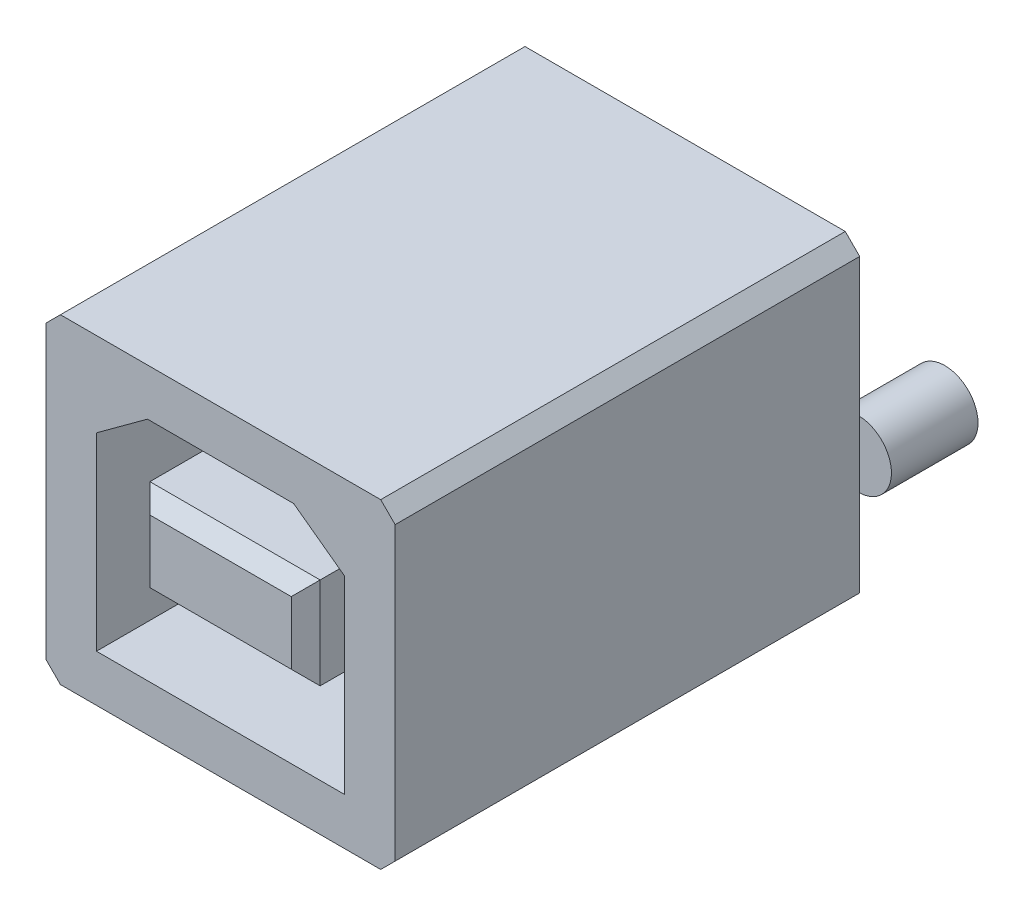
ISO-10303-21;
HEADER;
FILE_DESCRIPTION(('STEP AP214'),'2;1');
FILE_NAME('part.step','',(''),(''),'','','');
FILE_SCHEMA(('AUTOMOTIVE_DESIGN { 1 0 10303 214 1 1 1 1 }'));
ENDSEC;
DATA;
#1=APPLICATION_CONTEXT('core data for automotive mechanical design processes');
#2=APPLICATION_PROTOCOL_DEFINITION('international standard','automotive_design',2000,#1);
#3=PRODUCT_CONTEXT('',#1,'mechanical');
#4=PRODUCT('Part','Part','',(#3));
#5=PRODUCT_RELATED_PRODUCT_CATEGORY('part','',(#4));
#6=PRODUCT_DEFINITION_FORMATION('','',#4);
#7=PRODUCT_DEFINITION_CONTEXT('part definition',#1,'design');
#8=PRODUCT_DEFINITION('design','',#6,#7);
#9=PRODUCT_DEFINITION_SHAPE('','',#8);
#10=(LENGTH_UNIT() NAMED_UNIT(*) SI_UNIT(.MILLI.,.METRE.));
#11=(NAMED_UNIT(*) PLANE_ANGLE_UNIT() SI_UNIT($,.RADIAN.));
#12=(NAMED_UNIT(*) SI_UNIT($,.STERADIAN.) SOLID_ANGLE_UNIT());
#13=UNCERTAINTY_MEASURE_WITH_UNIT(LENGTH_MEASURE(1.E-05),#10,'distance_accuracy_value','');
#14=(GEOMETRIC_REPRESENTATION_CONTEXT(3) GLOBAL_UNCERTAINTY_ASSIGNED_CONTEXT((#13)) GLOBAL_UNIT_ASSIGNED_CONTEXT((#10,
#11,#12)) REPRESENTATION_CONTEXT('',''));
#15=CARTESIAN_POINT('',(0.,0.,0.));
#16=DIRECTION('',(0.,0.,1.));
#17=DIRECTION('',(1.,0.,0.));
#18=AXIS2_PLACEMENT_3D('',#15,#16,#17);
#19=CARTESIAN_POINT('',(0.,0.,16.1));
#20=DIRECTION('',(0.,0.,-1.));
#21=DIRECTION('',(-1.,0.,0.));
#22=AXIS2_PLACEMENT_3D('',#19,#20,#21);
#23=PLANE('',#22);
#24=DIRECTION('',(1.,0.,0.));
#25=VECTOR('',#24,1.);
#26=CARTESIAN_POINT('',(0.,-1.09,16.1));
#27=LINE('',#26,#25);
#28=CARTESIAN_POINT('',(2.45,-1.09,16.1));
#29=VERTEX_POINT('',#28);
#30=CARTESIAN_POINT('',(-2.45,-1.09,16.1));
#31=VERTEX_POINT('',#30);
#32=EDGE_CURVE('E359',#29,#31,#27,.F.);
#33=ORIENTED_EDGE('',*,*,#32,.F.);
#34=DIRECTION('',(0.,1.,0.));
#35=VECTOR('',#34,1.);
#36=CARTESIAN_POINT('',(2.45,0.,16.1));
#37=LINE('',#36,#35);
#38=CARTESIAN_POINT('',(2.45,1.09,16.1));
#39=VERTEX_POINT('',#38);
#40=EDGE_CURVE('E354',#39,#29,#37,.F.);
#41=ORIENTED_EDGE('',*,*,#40,.F.);
#42=DIRECTION('',(1.,0.,0.));
#43=VECTOR('',#42,1.);
#44=CARTESIAN_POINT('',(0.,1.09,16.1));
#45=LINE('',#44,#43);
#46=CARTESIAN_POINT('',(-2.45,1.09,16.1));
#47=VERTEX_POINT('',#46);
#48=EDGE_CURVE('E369',#47,#39,#45,.T.);
#49=ORIENTED_EDGE('',*,*,#48,.F.);
#50=DIRECTION('',(0.,1.,0.));
#51=VECTOR('',#50,1.);
#52=CARTESIAN_POINT('',(-2.45,0.,16.1));
#53=LINE('',#52,#51);
#54=EDGE_CURVE('E364',#31,#47,#53,.T.);
#55=ORIENTED_EDGE('',*,*,#54,.F.);
#56=EDGE_LOOP('',(#33,#41,#49,#55));
#57=FACE_BOUND('',#56,.T.);
#58=ADVANCED_FACE('F16',(#57),#23,.F.);
#59=CARTESIAN_POINT('',(0.,1.09,16.1));
#60=DIRECTION('',(0.,0.707106781186548,0.707106781186548));
#61=DIRECTION('',(0.,-0.707106781186548,0.707106781186548));
#62=AXIS2_PLACEMENT_3D('',#59,#60,#61);
#63=PLANE('',#62);
#64=DIRECTION('',(-0.577350269189626,0.577350269189624,-0.577350269189626));
#65=VECTOR('',#64,1.);
#66=CARTESIAN_POINT('',(-2.45,1.09,16.1));
#67=LINE('',#66,#65);
#68=CARTESIAN_POINT('',(-2.95,1.59,15.6));
#69=VERTEX_POINT('',#68);
#70=EDGE_CURVE('E367',#47,#69,#67,.T.);
#71=ORIENTED_EDGE('',*,*,#70,.F.);
#72=ORIENTED_EDGE('',*,*,#48,.T.);
#73=DIRECTION('',(-0.577350269189626,-0.577350269189624,0.577350269189626));
#74=VECTOR('',#73,1.);
#75=CARTESIAN_POINT('',(2.95,1.59,15.6));
#76=LINE('',#75,#74);
#77=CARTESIAN_POINT('',(2.95,1.59,15.6));
#78=VERTEX_POINT('',#77);
#79=EDGE_CURVE('E356',#78,#39,#76,.T.);
#80=ORIENTED_EDGE('',*,*,#79,.F.);
#81=DIRECTION('',(1.,0.,0.));
#82=VECTOR('',#81,1.);
#83=CARTESIAN_POINT('',(-2.95,1.59,15.6));
#84=LINE('',#83,#82);
#85=EDGE_CURVE('E350',#69,#78,#84,.T.);
#86=ORIENTED_EDGE('',*,*,#85,.F.);
#87=EDGE_LOOP('',(#71,#72,#80,#86));
#88=FACE_BOUND('',#87,.T.);
#89=ADVANCED_FACE('F772',(#88),#63,.T.);
#90=CARTESIAN_POINT('',(-2.45,0.,16.1));
#91=DIRECTION('',(-0.707106781186548,0.,0.707106781186548));
#92=DIRECTION('',(0.707106781186548,0.,0.707106781186548));
#93=AXIS2_PLACEMENT_3D('',#90,#91,#92);
#94=PLANE('',#93);
#95=DIRECTION('',(-0.577350269189625,-0.577350269189626,-0.577350269189626));
#96=VECTOR('',#95,1.);
#97=CARTESIAN_POINT('',(-2.45,-1.09,16.1));
#98=LINE('',#97,#96);
#99=CARTESIAN_POINT('',(-2.95,-1.59,15.6));
#100=VERTEX_POINT('',#99);
#101=EDGE_CURVE('E362',#31,#100,#98,.T.);
#102=ORIENTED_EDGE('',*,*,#101,.F.);
#103=ORIENTED_EDGE('',*,*,#54,.T.);
#104=ORIENTED_EDGE('',*,*,#70,.T.);
#105=DIRECTION('',(0.,1.,0.));
#106=VECTOR('',#105,1.);
#107=CARTESIAN_POINT('',(-2.95,1.59,15.6));
#108=LINE('',#107,#106);
#109=EDGE_CURVE('E347',#100,#69,#108,.T.);
#110=ORIENTED_EDGE('',*,*,#109,.F.);
#111=EDGE_LOOP('',(#102,#103,#104,#110));
#112=FACE_BOUND('',#111,.T.);
#113=ADVANCED_FACE('F763',(#112),#94,.T.);
#114=CARTESIAN_POINT('',(0.,-1.09,16.1));
#115=DIRECTION('',(0.,-0.707106781186548,0.707106781186548));
#116=DIRECTION('',(0.,-0.707106781186548,-0.707106781186548));
#117=AXIS2_PLACEMENT_3D('',#114,#115,#116);
#118=PLANE('',#117);
#119=DIRECTION('',(0.577350269189626,-0.577350269189624,-0.577350269189626));
#120=VECTOR('',#119,1.);
#121=CARTESIAN_POINT('',(2.45,-1.09,16.1));
#122=LINE('',#121,#120);
#123=CARTESIAN_POINT('',(2.95,-1.59,15.6));
#124=VERTEX_POINT('',#123);
#125=EDGE_CURVE('E352',#29,#124,#122,.T.);
#126=ORIENTED_EDGE('',*,*,#125,.F.);
#127=ORIENTED_EDGE('',*,*,#32,.T.);
#128=ORIENTED_EDGE('',*,*,#101,.T.);
#129=DIRECTION('',(1.,0.,0.));
#130=VECTOR('',#129,1.);
#131=CARTESIAN_POINT('',(-2.95,-1.59,15.6));
#132=LINE('',#131,#130);
#133=EDGE_CURVE('E342',#124,#100,#132,.F.);
#134=ORIENTED_EDGE('',*,*,#133,.F.);
#135=EDGE_LOOP('',(#126,#127,#128,#134));
#136=FACE_BOUND('',#135,.T.);
#137=ADVANCED_FACE('F754',(#136),#118,.T.);
#138=CARTESIAN_POINT('',(2.45,0.,16.1));
#139=DIRECTION('',(0.707106781186548,0.,0.707106781186548));
#140=DIRECTION('',(0.707106781186548,0.,-0.707106781186548));
#141=AXIS2_PLACEMENT_3D('',#138,#139,#140);
#142=PLANE('',#141);
#143=ORIENTED_EDGE('',*,*,#125,.T.);
#144=DIRECTION('',(0.,1.,0.));
#145=VECTOR('',#144,1.);
#146=CARTESIAN_POINT('',(2.95,1.59,15.6));
#147=LINE('',#146,#145);
#148=EDGE_CURVE('E334',#78,#124,#147,.F.);
#149=ORIENTED_EDGE('',*,*,#148,.F.);
#150=ORIENTED_EDGE('',*,*,#79,.T.);
#151=ORIENTED_EDGE('',*,*,#40,.T.);
#152=EDGE_LOOP('',(#143,#149,#150,#151));
#153=FACE_BOUND('',#152,.T.);
#154=ADVANCED_FACE('F745',(#153),#142,.T.);
#155=CARTESIAN_POINT('',(-2.95,1.59,8.1));
#156=DIRECTION('',(0.,1.,0.));
#157=DIRECTION('',(0.,0.,1.));
#158=AXIS2_PLACEMENT_3D('',#155,#156,#157);
#159=PLANE('',#158);
#160=DIRECTION('',(0.,0.,1.));
#161=VECTOR('',#160,1.);
#162=CARTESIAN_POINT('',(2.95,1.59,8.1));
#163=LINE('',#162,#161);
#164=CARTESIAN_POINT('',(2.95,1.59,8.1));
#165=VERTEX_POINT('',#164);
#166=EDGE_CURVE('E337',#165,#78,#163,.T.);
#167=ORIENTED_EDGE('',*,*,#166,.F.);
#168=DIRECTION('',(-1.,0.,0.));
#169=VECTOR('',#168,1.);
#170=CARTESIAN_POINT('',(0.,1.59,8.1));
#171=LINE('',#170,#169);
#172=CARTESIAN_POINT('',(-2.95,1.59,8.1));
#173=VERTEX_POINT('',#172);
#174=EDGE_CURVE('E310',#165,#173,#171,.T.);
#175=ORIENTED_EDGE('',*,*,#174,.T.);
#176=DIRECTION('',(0.,0.,1.));
#177=VECTOR('',#176,1.);
#178=CARTESIAN_POINT('',(-2.95,1.59,8.1));
#179=LINE('',#178,#177);
#180=EDGE_CURVE('E345',#69,#173,#179,.F.);
#181=ORIENTED_EDGE('',*,*,#180,.F.);
#182=ORIENTED_EDGE('',*,*,#85,.T.);
#183=EDGE_LOOP('',(#167,#175,#181,#182));
#184=FACE_BOUND('',#183,.T.);
#185=ADVANCED_FACE('F736',(#184),#159,.T.);
#186=CARTESIAN_POINT('',(-2.95,1.59,8.1));
#187=DIRECTION('',(-1.,0.,0.));
#188=DIRECTION('',(0.,0.,1.));
#189=AXIS2_PLACEMENT_3D('',#186,#187,#188);
#190=PLANE('',#189);
#191=ORIENTED_EDGE('',*,*,#180,.T.);
#192=DIRECTION('',(0.,1.,0.));
#193=VECTOR('',#192,1.);
#194=CARTESIAN_POINT('',(-2.95,0.,8.1));
#195=LINE('',#194,#193);
#196=CARTESIAN_POINT('',(-2.95,-1.59,8.1));
#197=VERTEX_POINT('',#196);
#198=EDGE_CURVE('E307',#173,#197,#195,.F.);
#199=ORIENTED_EDGE('',*,*,#198,.T.);
#200=DIRECTION('',(0.,0.,-1.));
#201=VECTOR('',#200,1.);
#202=CARTESIAN_POINT('',(-2.95,-1.59,8.1));
#203=LINE('',#202,#201);
#204=EDGE_CURVE('E340',#100,#197,#203,.T.);
#205=ORIENTED_EDGE('',*,*,#204,.F.);
#206=ORIENTED_EDGE('',*,*,#109,.T.);
#207=EDGE_LOOP('',(#191,#199,#205,#206));
#208=FACE_BOUND('',#207,.T.);
#209=ADVANCED_FACE('F727',(#208),#190,.T.);
#210=CARTESIAN_POINT('',(-2.95,-1.59,8.1));
#211=DIRECTION('',(0.,-1.,0.));
#212=DIRECTION('',(0.,0.,-1.));
#213=AXIS2_PLACEMENT_3D('',#210,#211,#212);
#214=PLANE('',#213);
#215=ORIENTED_EDGE('',*,*,#204,.T.);
#216=DIRECTION('',(-1.,0.,0.));
#217=VECTOR('',#216,1.);
#218=CARTESIAN_POINT('',(0.,-1.59,8.1));
#219=LINE('',#218,#217);
#220=CARTESIAN_POINT('',(2.95,-1.59,8.1));
#221=VERTEX_POINT('',#220);
#222=EDGE_CURVE('E304',#197,#221,#219,.F.);
#223=ORIENTED_EDGE('',*,*,#222,.T.);
#224=DIRECTION('',(0.,0.,1.));
#225=VECTOR('',#224,1.);
#226=CARTESIAN_POINT('',(2.95,-1.59,8.1));
#227=LINE('',#226,#225);
#228=EDGE_CURVE('E313',#124,#221,#227,.F.);
#229=ORIENTED_EDGE('',*,*,#228,.F.);
#230=ORIENTED_EDGE('',*,*,#133,.T.);
#231=EDGE_LOOP('',(#215,#223,#229,#230));
#232=FACE_BOUND('',#231,.T.);
#233=ADVANCED_FACE('F413',(#232),#214,.T.);
#234=CARTESIAN_POINT('',(2.95,1.59,8.1));
#235=DIRECTION('',(1.,0.,0.));
#236=DIRECTION('',(0.,1.,0.));
#237=AXIS2_PLACEMENT_3D('',#234,#235,#236);
#238=PLANE('',#237);
#239=ORIENTED_EDGE('',*,*,#228,.T.);
#240=DIRECTION('',(0.,1.,0.));
#241=VECTOR('',#240,1.);
#242=CARTESIAN_POINT('',(2.95,0.,8.1));
#243=LINE('',#242,#241);
#244=EDGE_CURVE('E296',#221,#165,#243,.T.);
#245=ORIENTED_EDGE('',*,*,#244,.T.);
#246=ORIENTED_EDGE('',*,*,#166,.T.);
#247=ORIENTED_EDGE('',*,*,#148,.T.);
#248=EDGE_LOOP('',(#239,#245,#246,#247));
#249=FACE_BOUND('',#248,.T.);
#250=ADVANCED_FACE('F403',(#249),#238,.T.);
#251=CARTESIAN_POINT('',(1.25,1.6,-3.));
#252=DIRECTION('',(0.,0.,-1.));
#253=DIRECTION('',(-1.,0.,0.));
#254=AXIS2_PLACEMENT_3D('',#251,#252,#253);
#255=PLANE('',#254);
#256=CARTESIAN_POINT('',(1.25,1.6,-3.));
#257=DIRECTION('',(0.,0.,1.));
#258=DIRECTION('',(1.,0.,0.));
#259=AXIS2_PLACEMENT_3D('',#256,#257,#258);
#260=CIRCLE('',#259,0.475);
#261=CARTESIAN_POINT('',(1.725,1.6,-3.));
#262=VERTEX_POINT('',#261);
#263=EDGE_CURVE('E19',#262,#262,#260,.T.);
#264=ORIENTED_EDGE('',*,*,#263,.F.);
#265=EDGE_LOOP('',(#264));
#266=FACE_BOUND('',#265,.T.);
#267=ADVANCED_FACE('F400',(#266),#255,.T.);
#268=CARTESIAN_POINT('',(-1.25,-1.6,-3.));
#269=DIRECTION('',(0.,0.,-1.));
#270=DIRECTION('',(-1.,0.,0.));
#271=AXIS2_PLACEMENT_3D('',#268,#269,#270);
#272=PLANE('',#271);
#273=CARTESIAN_POINT('',(-1.25,-1.6,-3.));
#274=DIRECTION('',(0.,0.,1.));
#275=DIRECTION('',(1.,0.,0.));
#276=AXIS2_PLACEMENT_3D('',#273,#274,#275);
#277=CIRCLE('',#276,0.475);
#278=CARTESIAN_POINT('',(-0.775,-1.6,-3.));
#279=VERTEX_POINT('',#278);
#280=EDGE_CURVE('E391',#279,#279,#277,.T.);
#281=ORIENTED_EDGE('',*,*,#280,.F.);
#282=EDGE_LOOP('',(#281));
#283=FACE_BOUND('',#282,.T.);
#284=ADVANCED_FACE('F402',(#283),#272,.T.);
#285=CARTESIAN_POINT('',(-1.25,1.6,-3.));
#286=DIRECTION('',(0.,0.,-1.));
#287=DIRECTION('',(-1.,0.,0.));
#288=AXIS2_PLACEMENT_3D('',#285,#286,#287);
#289=PLANE('',#288);
#290=CARTESIAN_POINT('',(-1.25,1.6,-3.));
#291=DIRECTION('',(0.,0.,1.));
#292=DIRECTION('',(1.,0.,0.));
#293=AXIS2_PLACEMENT_3D('',#290,#291,#292);
#294=CIRCLE('',#293,0.475);
#295=CARTESIAN_POINT('',(-0.775,1.6,-3.));
#296=VERTEX_POINT('',#295);
#297=EDGE_CURVE('E389',#296,#296,#294,.T.);
#298=ORIENTED_EDGE('',*,*,#297,.F.);
#299=EDGE_LOOP('',(#298));
#300=FACE_BOUND('',#299,.T.);
#301=ADVANCED_FACE('F410',(#300),#289,.T.);
#302=CARTESIAN_POINT('',(1.25,-1.6,-3.));
#303=DIRECTION('',(0.,0.,-1.));
#304=DIRECTION('',(-1.,0.,0.));
#305=AXIS2_PLACEMENT_3D('',#302,#303,#304);
#306=PLANE('',#305);
#307=CARTESIAN_POINT('',(1.25,-1.6,-3.));
#308=DIRECTION('',(0.,0.,1.));
#309=DIRECTION('',(1.,0.,0.));
#310=AXIS2_PLACEMENT_3D('',#307,#308,#309);
#311=CIRCLE('',#310,0.475);
#312=CARTESIAN_POINT('',(1.725,-1.6,-3.));
#313=VERTEX_POINT('',#312);
#314=EDGE_CURVE('E386',#313,#313,#311,.T.);
#315=ORIENTED_EDGE('',*,*,#314,.F.);
#316=EDGE_LOOP('',(#315));
#317=FACE_BOUND('',#316,.T.);
#318=ADVANCED_FACE('F518',(#317),#306,.T.);
#319=CARTESIAN_POINT('',(6.,-0.9,-3.));
#320=DIRECTION('',(0.,0.,-1.));
#321=DIRECTION('',(-1.,0.,0.));
#322=AXIS2_PLACEMENT_3D('',#319,#320,#321);
#323=PLANE('',#322);
#324=CARTESIAN_POINT('',(6.,-0.9,-3.));
#325=DIRECTION('',(0.,0.,1.));
#326=DIRECTION('',(1.,0.,0.));
#327=AXIS2_PLACEMENT_3D('',#324,#325,#326);
#328=CIRCLE('',#327,1.15);
#329=CARTESIAN_POINT('',(7.15,-0.9,-3.));
#330=VERTEX_POINT('',#329);
#331=EDGE_CURVE('E171',#330,#330,#328,.T.);
#332=ORIENTED_EDGE('',*,*,#331,.F.);
#333=EDGE_LOOP('',(#332));
#334=FACE_BOUND('',#333,.T.);
#335=ADVANCED_FACE('F514',(#334),#323,.T.);
#336=CARTESIAN_POINT('',(-6.,-0.9,-3.));
#337=DIRECTION('',(0.,0.,-1.));
#338=DIRECTION('',(-1.,0.,0.));
#339=AXIS2_PLACEMENT_3D('',#336,#337,#338);
#340=PLANE('',#339);
#341=CARTESIAN_POINT('',(-6.,-0.9,-3.));
#342=DIRECTION('',(0.,0.,1.));
#343=DIRECTION('',(1.,0.,0.));
#344=AXIS2_PLACEMENT_3D('',#341,#342,#343);
#345=CIRCLE('',#344,1.15);
#346=CARTESIAN_POINT('',(-4.85,-0.9,-3.));
#347=VERTEX_POINT('',#346);
#348=EDGE_CURVE('E170',#347,#347,#345,.T.);
#349=ORIENTED_EDGE('',*,*,#348,.F.);
#350=EDGE_LOOP('',(#349));
#351=FACE_BOUND('',#350,.T.);
#352=ADVANCED_FACE('F510',(#351),#340,.T.);
#353=CARTESIAN_POINT('',(0.,0.,8.1));
#354=DIRECTION('',(0.,0.,-1.));
#355=DIRECTION('',(-1.,0.,0.));
#356=AXIS2_PLACEMENT_3D('',#353,#354,#355);
#357=PLANE('',#356);
#358=DIRECTION('',(0.,1.,0.));
#359=VECTOR('',#358,1.);
#360=CARTESIAN_POINT('',(-4.3,2.630645035576,8.1));
#361=LINE('',#360,#359);
#362=CARTESIAN_POINT('',(-4.3000000000002,2.63064503557627,8.1));
#363=VERTEX_POINT('',#362);
#364=CARTESIAN_POINT('',(-4.3,-3.925,8.1));
#365=VERTEX_POINT('',#364);
#366=EDGE_CURVE('E208',#363,#365,#361,.F.);
#367=ORIENTED_EDGE('',*,*,#366,.T.);
#368=DIRECTION('',(1.,0.,0.));
#369=VECTOR('',#368,1.);
#370=CARTESIAN_POINT('',(-4.3,-3.925,8.1));
#371=LINE('',#370,#369);
#372=CARTESIAN_POINT('',(4.3,-3.925,8.1));
#373=VERTEX_POINT('',#372);
#374=EDGE_CURVE('E234',#365,#373,#371,.T.);
#375=ORIENTED_EDGE('',*,*,#374,.T.);
#376=DIRECTION('',(0.,1.,0.));
#377=VECTOR('',#376,1.);
#378=CARTESIAN_POINT('',(4.3,-3.925,8.1));
#379=LINE('',#378,#377);
#380=CARTESIAN_POINT('',(4.3,2.630645035576,8.1));
#381=VERTEX_POINT('',#380);
#382=EDGE_CURVE('E229',#373,#381,#379,.T.);
#383=ORIENTED_EDGE('',*,*,#382,.T.);
#384=DIRECTION('',(-0.8066910636773,0.59097337315922,0.));
#385=VECTOR('',#384,1.);
#386=CARTESIAN_POINT('',(4.3,2.630645035576,8.1));
#387=LINE('',#386,#385);
#388=CARTESIAN_POINT('',(2.5331782945738,3.92499999999973,8.1));
#389=VERTEX_POINT('',#388);
#390=EDGE_CURVE('E224',#381,#389,#387,.T.);
#391=ORIENTED_EDGE('',*,*,#390,.T.);
#392=DIRECTION('',(1.,0.,0.));
#393=VECTOR('',#392,1.);
#394=CARTESIAN_POINT('',(2.533178294574,3.925,8.1));
#395=LINE('',#394,#393);
#396=CARTESIAN_POINT('',(-2.533178294574,3.925,8.1));
#397=VERTEX_POINT('',#396);
#398=EDGE_CURVE('E219',#389,#397,#395,.F.);
#399=ORIENTED_EDGE('',*,*,#398,.T.);
#400=DIRECTION('',(-0.8066910636773,-0.59097337315922,0.));
#401=VECTOR('',#400,1.);
#402=CARTESIAN_POINT('',(-2.533178294574,3.925,8.1));
#403=LINE('',#402,#401);
#404=EDGE_CURVE('E214',#397,#363,#403,.T.);
#405=ORIENTED_EDGE('',*,*,#404,.T.);
#406=EDGE_LOOP('',(#367,#375,#383,#391,#399,#405));
#407=FACE_BOUND('',#406,.T.);
#408=ORIENTED_EDGE('',*,*,#222,.F.);
#409=ORIENTED_EDGE('',*,*,#198,.F.);
#410=ORIENTED_EDGE('',*,*,#174,.F.);
#411=ORIENTED_EDGE('',*,*,#244,.F.);
#412=EDGE_LOOP('',(#408,#409,#410,#411));
#413=FACE_BOUND('',#412,.T.);
#414=ADVANCED_FACE('F506',(#407,#413),#357,.F.);
#415=CARTESIAN_POINT('',(-6.,-0.9,0.));
#416=DIRECTION('',(0.,0.,-1.));
#417=DIRECTION('',(-1.,0.,0.));
#418=AXIS2_PLACEMENT_3D('',#415,#416,#417);
#419=PLANE('',#418);
#420=DIRECTION('',(0.,1.,0.));
#421=VECTOR('',#420,1.);
#422=CARTESIAN_POINT('',(-6.05,-5.55,0.));
#423=LINE('',#422,#421);
#424=CARTESIAN_POINT('',(-6.05,-2.0489125293078,0.));
#425=VERTEX_POINT('',#424);
#426=CARTESIAN_POINT('',(-6.05,0.248912529307803,0.));
#427=VERTEX_POINT('',#426);
#428=EDGE_CURVE('E237',#425,#427,#423,.T.);
#429=ORIENTED_EDGE('',*,*,#428,.T.);
#430=CARTESIAN_POINT('',(-6.,-0.9,0.));
#431=DIRECTION('',(0.,0.,1.));
#432=DIRECTION('',(1.,0.,0.));
#433=AXIS2_PLACEMENT_3D('',#430,#431,#432);
#434=CIRCLE('',#433,1.15);
#435=EDGE_CURVE('E236',#425,#427,#434,.F.);
#436=ORIENTED_EDGE('',*,*,#435,.F.);
#437=EDGE_LOOP('',(#429,#436));
#438=FACE_BOUND('',#437,.T.);
#439=ADVANCED_FACE('F502',(#438),#419,.F.);
#440=CARTESIAN_POINT('',(-5.55,-5.55,16.1));
#441=DIRECTION('',(0.707106781186548,0.707106781186548,0.));
#442=DIRECTION('',(-0.707106781186548,0.707106781186548,0.));
#443=AXIS2_PLACEMENT_3D('',#440,#441,#442);
#444=PLANE('',#443);
#445=DIRECTION('',(0.,0.,-1.));
#446=VECTOR('',#445,1.);
#447=CARTESIAN_POINT('',(-6.05,-5.05,16.1));
#448=LINE('',#447,#446);
#449=CARTESIAN_POINT('',(-6.05,-5.05,16.1));
#450=VERTEX_POINT('',#449);
#451=CARTESIAN_POINT('',(-6.05,-5.05,0.));
#452=VERTEX_POINT('',#451);
#453=EDGE_CURVE('E186',#450,#452,#448,.T.);
#454=ORIENTED_EDGE('',*,*,#453,.T.);
#455=DIRECTION('',(-0.707106781186548,0.707106781186548,0.));
#456=VECTOR('',#455,1.);
#457=CARTESIAN_POINT('',(-5.55,-5.55,0.));
#458=LINE('',#457,#456);
#459=CARTESIAN_POINT('',(-5.55,-5.55,0.));
#460=VERTEX_POINT('',#459);
#461=EDGE_CURVE('E294',#460,#452,#458,.T.);
#462=ORIENTED_EDGE('',*,*,#461,.F.);
#463=DIRECTION('',(0.,0.,1.));
#464=VECTOR('',#463,1.);
#465=CARTESIAN_POINT('',(-5.55,-5.55,16.1));
#466=LINE('',#465,#464);
#467=CARTESIAN_POINT('',(-5.55,-5.55,16.1));
#468=VERTEX_POINT('',#467);
#469=EDGE_CURVE('E207',#460,#468,#466,.T.);
#470=ORIENTED_EDGE('',*,*,#469,.T.);
#471=DIRECTION('',(-0.707106781186548,0.707106781186548,0.));
#472=VECTOR('',#471,1.);
#473=CARTESIAN_POINT('',(-5.55,-5.55,16.1));
#474=LINE('',#473,#472);
#475=EDGE_CURVE('E282',#450,#468,#474,.F.);
#476=ORIENTED_EDGE('',*,*,#475,.F.);
#477=EDGE_LOOP('',(#454,#462,#470,#476));
#478=FACE_BOUND('',#477,.T.);
#479=ADVANCED_FACE('F499',(#478),#444,.F.);
#480=CARTESIAN_POINT('',(6.,-0.9,0.));
#481=DIRECTION('',(0.,0.,-1.));
#482=DIRECTION('',(-1.,0.,0.));
#483=AXIS2_PLACEMENT_3D('',#480,#481,#482);
#484=PLANE('',#483);
#485=DIRECTION('',(0.,1.,0.));
#486=VECTOR('',#485,1.);
#487=CARTESIAN_POINT('',(6.05,-5.55,0.));
#488=LINE('',#487,#486);
#489=CARTESIAN_POINT('',(6.05,0.248912529307803,0.));
#490=VERTEX_POINT('',#489);
#491=CARTESIAN_POINT('',(6.05,-2.0489125293078,0.));
#492=VERTEX_POINT('',#491);
#493=EDGE_CURVE('E168',#490,#492,#488,.F.);
#494=ORIENTED_EDGE('',*,*,#493,.T.);
#495=CARTESIAN_POINT('',(6.,-0.9,0.));
#496=DIRECTION('',(0.,0.,1.));
#497=DIRECTION('',(1.,0.,0.));
#498=AXIS2_PLACEMENT_3D('',#495,#496,#497);
#499=CIRCLE('',#498,1.15);
#500=EDGE_CURVE('E162',#490,#492,#499,.F.);
#501=ORIENTED_EDGE('',*,*,#500,.F.);
#502=EDGE_LOOP('',(#494,#501));
#503=FACE_BOUND('',#502,.T.);
#504=ADVANCED_FACE('F166',(#503),#484,.F.);
#505=CARTESIAN_POINT('',(6.05,-5.05,16.1));
#506=DIRECTION('',(-0.707106781186548,0.707106781186548,0.));
#507=DIRECTION('',(-0.707106781186548,-0.707106781186548,0.));
#508=AXIS2_PLACEMENT_3D('',#505,#506,#507);
#509=PLANE('',#508);
#510=DIRECTION('',(0.,0.,1.));
#511=VECTOR('',#510,1.);
#512=CARTESIAN_POINT('',(5.55,-5.55,16.1));
#513=LINE('',#512,#511);
#514=CARTESIAN_POINT('',(5.55,-5.55,16.1));
#515=VERTEX_POINT('',#514);
#516=CARTESIAN_POINT('',(5.55,-5.55,0.));
#517=VERTEX_POINT('',#516);
#518=EDGE_CURVE('E240',#515,#517,#513,.F.);
#519=ORIENTED_EDGE('',*,*,#518,.T.);
#520=DIRECTION('',(-0.707106781186548,-0.707106781186548,0.));
#521=VECTOR('',#520,1.);
#522=CARTESIAN_POINT('',(6.05,-5.05,0.));
#523=LINE('',#522,#521);
#524=CARTESIAN_POINT('',(6.05,-5.05,0.));
#525=VERTEX_POINT('',#524);
#526=EDGE_CURVE('E279',#525,#517,#523,.T.);
#527=ORIENTED_EDGE('',*,*,#526,.F.);
#528=DIRECTION('',(0.,0.,1.));
#529=VECTOR('',#528,1.);
#530=CARTESIAN_POINT('',(6.05,-5.05,16.1));
#531=LINE('',#530,#529);
#532=CARTESIAN_POINT('',(6.05,-5.05,16.1));
#533=VERTEX_POINT('',#532);
#534=EDGE_CURVE('E185',#525,#533,#531,.T.);
#535=ORIENTED_EDGE('',*,*,#534,.T.);
#536=DIRECTION('',(-0.707106781186548,-0.707106781186548,0.));
#537=VECTOR('',#536,1.);
#538=CARTESIAN_POINT('',(6.05,-5.05,16.1));
#539=LINE('',#538,#537);
#540=EDGE_CURVE('E281',#515,#533,#539,.F.);
#541=ORIENTED_EDGE('',*,*,#540,.F.);
#542=EDGE_LOOP('',(#519,#527,#535,#541));
#543=FACE_BOUND('',#542,.T.);
#544=ADVANCED_FACE('F492',(#543),#509,.F.);
#545=CARTESIAN_POINT('',(1.25,1.6,-3.));
#546=DIRECTION('',(0.,0.,1.));
#547=DIRECTION('',(1.,0.,0.));
#548=AXIS2_PLACEMENT_3D('',#545,#546,#547);
#549=CYLINDRICAL_SURFACE('',#548,0.475);
#550=CARTESIAN_POINT('',(1.25,1.6,0.));
#551=DIRECTION('',(0.,0.,1.));
#552=DIRECTION('',(1.,0.,0.));
#553=AXIS2_PLACEMENT_3D('',#550,#551,#552);
#554=CIRCLE('',#553,0.475);
#555=CARTESIAN_POINT('',(1.725,1.6,0.));
#556=VERTEX_POINT('',#555);
#557=EDGE_CURVE('E244',#556,#556,#554,.T.);
#558=ORIENTED_EDGE('',*,*,#557,.F.);
#559=EDGE_LOOP('',(#558));
#560=FACE_BOUND('',#559,.T.);
#561=ORIENTED_EDGE('',*,*,#263,.T.);
#562=EDGE_LOOP('',(#561));
#563=FACE_BOUND('',#562,.T.);
#564=ADVANCED_FACE('F398',(#560,#563),#549,.T.);
#565=CARTESIAN_POINT('',(-1.25,-1.6,-3.));
#566=DIRECTION('',(0.,0.,1.));
#567=DIRECTION('',(1.,0.,0.));
#568=AXIS2_PLACEMENT_3D('',#565,#566,#567);
#569=CYLINDRICAL_SURFACE('',#568,0.475);
#570=CARTESIAN_POINT('',(-1.25,-1.6,0.));
#571=DIRECTION('',(0.,0.,1.));
#572=DIRECTION('',(1.,0.,0.));
#573=AXIS2_PLACEMENT_3D('',#570,#571,#572);
#574=CIRCLE('',#573,0.475);
#575=CARTESIAN_POINT('',(-0.775,-1.6,0.));
#576=VERTEX_POINT('',#575);
#577=EDGE_CURVE('E376',#576,#576,#574,.T.);
#578=ORIENTED_EDGE('',*,*,#577,.F.);
#579=EDGE_LOOP('',(#578));
#580=FACE_BOUND('',#579,.T.);
#581=ORIENTED_EDGE('',*,*,#280,.T.);
#582=EDGE_LOOP('',(#581));
#583=FACE_BOUND('',#582,.T.);
#584=ADVANCED_FACE('F485',(#580,#583),#569,.T.);
#585=CARTESIAN_POINT('',(-1.25,1.6,-3.));
#586=DIRECTION('',(0.,0.,1.));
#587=DIRECTION('',(1.,0.,0.));
#588=AXIS2_PLACEMENT_3D('',#585,#586,#587);
#589=CYLINDRICAL_SURFACE('',#588,0.475);
#590=CARTESIAN_POINT('',(-1.25,1.6,0.));
#591=DIRECTION('',(0.,0.,1.));
#592=DIRECTION('',(1.,0.,0.));
#593=AXIS2_PLACEMENT_3D('',#590,#591,#592);
#594=CIRCLE('',#593,0.475);
#595=CARTESIAN_POINT('',(-0.775,1.6,0.));
#596=VERTEX_POINT('',#595);
#597=EDGE_CURVE('E196',#596,#596,#594,.T.);
#598=ORIENTED_EDGE('',*,*,#597,.F.);
#599=EDGE_LOOP('',(#598));
#600=FACE_BOUND('',#599,.T.);
#601=ORIENTED_EDGE('',*,*,#297,.T.);
#602=EDGE_LOOP('',(#601));
#603=FACE_BOUND('',#602,.T.);
#604=ADVANCED_FACE('F481',(#600,#603),#589,.T.);
#605=CARTESIAN_POINT('',(1.25,-1.6,-3.));
#606=DIRECTION('',(0.,0.,1.));
#607=DIRECTION('',(1.,0.,0.));
#608=AXIS2_PLACEMENT_3D('',#605,#606,#607);
#609=CYLINDRICAL_SURFACE('',#608,0.475);
#610=CARTESIAN_POINT('',(1.25,-1.6,0.));
#611=DIRECTION('',(0.,0.,1.));
#612=DIRECTION('',(1.,0.,0.));
#613=AXIS2_PLACEMENT_3D('',#610,#611,#612);
#614=CIRCLE('',#613,0.475);
#615=CARTESIAN_POINT('',(1.725,-1.6,0.));
#616=VERTEX_POINT('',#615);
#617=EDGE_CURVE('E193',#616,#616,#614,.T.);
#618=ORIENTED_EDGE('',*,*,#617,.F.);
#619=EDGE_LOOP('',(#618));
#620=FACE_BOUND('',#619,.T.);
#621=ORIENTED_EDGE('',*,*,#314,.T.);
#622=EDGE_LOOP('',(#621));
#623=FACE_BOUND('',#622,.T.);
#624=ADVANCED_FACE('F477',(#620,#623),#609,.T.);
#625=CARTESIAN_POINT('',(6.,-0.9,-3.));
#626=DIRECTION('',(0.,0.,1.));
#627=DIRECTION('',(1.,0.,0.));
#628=AXIS2_PLACEMENT_3D('',#625,#626,#627);
#629=CYLINDRICAL_SURFACE('',#628,1.15);
#630=ORIENTED_EDGE('',*,*,#331,.T.);
#631=EDGE_LOOP('',(#630));
#632=FACE_BOUND('',#631,.T.);
#633=ORIENTED_EDGE('',*,*,#500,.T.);
#634=CARTESIAN_POINT('',(6.,-0.9,0.));
#635=DIRECTION('',(0.,0.,1.));
#636=DIRECTION('',(1.,0.,0.));
#637=AXIS2_PLACEMENT_3D('',#634,#635,#636);
#638=CIRCLE('',#637,1.15);
#639=EDGE_CURVE('E173',#490,#492,#638,.T.);
#640=ORIENTED_EDGE('',*,*,#639,.F.);
#641=EDGE_LOOP('',(#633,#640));
#642=FACE_BOUND('',#641,.T.);
#643=ADVANCED_FACE('F174',(#632,#642),#629,.T.);
#644=CARTESIAN_POINT('',(-6.,-0.9,-3.));
#645=DIRECTION('',(0.,0.,1.));
#646=DIRECTION('',(1.,0.,0.));
#647=AXIS2_PLACEMENT_3D('',#644,#645,#646);
#648=CYLINDRICAL_SURFACE('',#647,1.15);
#649=CARTESIAN_POINT('',(-6.,-0.9,0.));
#650=DIRECTION('',(0.,0.,1.));
#651=DIRECTION('',(1.,0.,0.));
#652=AXIS2_PLACEMENT_3D('',#649,#650,#651);
#653=CIRCLE('',#652,1.15);
#654=EDGE_CURVE('E371',#425,#427,#653,.T.);
#655=ORIENTED_EDGE('',*,*,#654,.F.);
#656=ORIENTED_EDGE('',*,*,#435,.T.);
#657=EDGE_LOOP('',(#655,#656));
#658=FACE_BOUND('',#657,.T.);
#659=ORIENTED_EDGE('',*,*,#348,.T.);
#660=EDGE_LOOP('',(#659));
#661=FACE_BOUND('',#660,.T.);
#662=ADVANCED_FACE('F470',(#658,#661),#648,.T.);
#663=CARTESIAN_POINT('',(-4.3,-3.925,8.1));
#664=DIRECTION('',(0.,-1.,0.));
#665=DIRECTION('',(0.,0.,-1.));
#666=AXIS2_PLACEMENT_3D('',#663,#664,#665);
#667=PLANE('',#666);
#668=DIRECTION('',(0.,0.,-1.));
#669=VECTOR('',#668,1.);
#670=CARTESIAN_POINT('',(4.3,-3.925,8.1));
#671=LINE('',#670,#669);
#672=CARTESIAN_POINT('',(4.3,-3.925,16.1));
#673=VERTEX_POINT('',#672);
#674=EDGE_CURVE('E231',#673,#373,#671,.T.);
#675=ORIENTED_EDGE('',*,*,#674,.T.);
#676=ORIENTED_EDGE('',*,*,#374,.F.);
#677=DIRECTION('',(0.,0.,1.));
#678=VECTOR('',#677,1.);
#679=CARTESIAN_POINT('',(-4.3,-3.925,8.1));
#680=LINE('',#679,#678);
#681=CARTESIAN_POINT('',(-4.3,-3.925,16.1));
#682=VERTEX_POINT('',#681);
#683=EDGE_CURVE('E204',#365,#682,#680,.T.);
#684=ORIENTED_EDGE('',*,*,#683,.T.);
#685=DIRECTION('',(-1.,0.,0.));
#686=VECTOR('',#685,1.);
#687=CARTESIAN_POINT('',(0.,-3.925,16.1));
#688=LINE('',#687,#686);
#689=EDGE_CURVE('E262',#682,#673,#688,.F.);
#690=ORIENTED_EDGE('',*,*,#689,.T.);
#691=EDGE_LOOP('',(#675,#676,#684,#690));
#692=FACE_BOUND('',#691,.T.);
#693=ADVANCED_FACE('F466',(#692),#667,.F.);
#694=CARTESIAN_POINT('',(4.3,-3.925,8.1));
#695=DIRECTION('',(1.,0.,0.));
#696=DIRECTION('',(0.,0.,-1.));
#697=AXIS2_PLACEMENT_3D('',#694,#695,#696);
#698=PLANE('',#697);
#699=DIRECTION('',(0.,0.,1.));
#700=VECTOR('',#699,1.);
#701=CARTESIAN_POINT('',(4.3,2.630645035576,8.1));
#702=LINE('',#701,#700);
#703=CARTESIAN_POINT('',(4.3,2.630645035576,16.1));
#704=VERTEX_POINT('',#703);
#705=EDGE_CURVE('E226',#704,#381,#702,.F.);
#706=ORIENTED_EDGE('',*,*,#705,.T.);
#707=ORIENTED_EDGE('',*,*,#382,.F.);
#708=ORIENTED_EDGE('',*,*,#674,.F.);
#709=DIRECTION('',(0.,1.,0.));
#710=VECTOR('',#709,1.);
#711=CARTESIAN_POINT('',(4.3,0.,16.1));
#712=LINE('',#711,#710);
#713=EDGE_CURVE('E842',#673,#704,#712,.T.);
#714=ORIENTED_EDGE('',*,*,#713,.T.);
#715=EDGE_LOOP('',(#706,#707,#708,#714));
#716=FACE_BOUND('',#715,.T.);
#717=ADVANCED_FACE('F462',(#716),#698,.F.);
#718=CARTESIAN_POINT('',(4.3,2.630645035576,8.1));
#719=DIRECTION('',(0.59097337315922,0.8066910636773,0.));
#720=DIRECTION('',(-0.8066910636773,0.59097337315922,0.));
#721=AXIS2_PLACEMENT_3D('',#718,#719,#720);
#722=PLANE('',#721);
#723=DIRECTION('',(0.,0.,1.));
#724=VECTOR('',#723,1.);
#725=CARTESIAN_POINT('',(2.533178294574,3.925,8.1));
#726=LINE('',#725,#724);
#727=CARTESIAN_POINT('',(2.5331782945738,3.92499999999973,16.1));
#728=VERTEX_POINT('',#727);
#729=EDGE_CURVE('E221',#728,#389,#726,.F.);
#730=ORIENTED_EDGE('',*,*,#729,.T.);
#731=ORIENTED_EDGE('',*,*,#390,.F.);
#732=ORIENTED_EDGE('',*,*,#705,.F.);
#733=DIRECTION('',(-0.806691063677122,0.590973373159463,0.));
#734=VECTOR('',#733,1.);
#735=CARTESIAN_POINT('',(4.3,2.630645035576,16.1));
#736=LINE('',#735,#734);
#737=EDGE_CURVE('E836',#704,#728,#736,.T.);
#738=ORIENTED_EDGE('',*,*,#737,.T.);
#739=EDGE_LOOP('',(#730,#731,#732,#738));
#740=FACE_BOUND('',#739,.T.);
#741=ADVANCED_FACE('F458',(#740),#722,.F.);
#742=CARTESIAN_POINT('',(2.533178294574,3.925,8.1));
#743=DIRECTION('',(0.,1.,0.));
#744=DIRECTION('',(0.,0.,1.));
#745=AXIS2_PLACEMENT_3D('',#742,#743,#744);
#746=PLANE('',#745);
#747=DIRECTION('',(0.,0.,1.));
#748=VECTOR('',#747,1.);
#749=CARTESIAN_POINT('',(-2.533178294574,3.925,8.1));
#750=LINE('',#749,#748);
#751=CARTESIAN_POINT('',(-2.533178294574,3.925,16.1));
#752=VERTEX_POINT('',#751);
#753=EDGE_CURVE('E216',#752,#397,#750,.F.);
#754=ORIENTED_EDGE('',*,*,#753,.T.);
#755=ORIENTED_EDGE('',*,*,#398,.F.);
#756=ORIENTED_EDGE('',*,*,#729,.F.);
#757=DIRECTION('',(-1.,0.,0.));
#758=VECTOR('',#757,1.);
#759=CARTESIAN_POINT('',(0.,3.925,16.1));
#760=LINE('',#759,#758);
#761=EDGE_CURVE('E833',#728,#752,#760,.T.);
#762=ORIENTED_EDGE('',*,*,#761,.T.);
#763=EDGE_LOOP('',(#754,#755,#756,#762));
#764=FACE_BOUND('',#763,.T.);
#765=ADVANCED_FACE('F454',(#764),#746,.F.);
#766=CARTESIAN_POINT('',(-2.533178294574,3.925,8.1));
#767=DIRECTION('',(-0.59097337315922,0.8066910636773,0.));
#768=DIRECTION('',(-0.8066910636773,-0.59097337315922,0.));
#769=AXIS2_PLACEMENT_3D('',#766,#767,#768);
#770=PLANE('',#769);
#771=DIRECTION('',(0.,0.,1.));
#772=VECTOR('',#771,1.);
#773=CARTESIAN_POINT('',(-4.3,2.630645035576,8.1));
#774=LINE('',#773,#772);
#775=CARTESIAN_POINT('',(-4.3000000000002,2.63064503557627,16.1));
#776=VERTEX_POINT('',#775);
#777=EDGE_CURVE('E211',#776,#363,#774,.F.);
#778=ORIENTED_EDGE('',*,*,#777,.T.);
#779=ORIENTED_EDGE('',*,*,#404,.F.);
#780=ORIENTED_EDGE('',*,*,#753,.F.);
#781=DIRECTION('',(-0.806691063677122,-0.590973373159463,0.));
#782=VECTOR('',#781,1.);
#783=CARTESIAN_POINT('',(-2.533178294574,3.925,16.1));
#784=LINE('',#783,#782);
#785=EDGE_CURVE('E829',#752,#776,#784,.T.);
#786=ORIENTED_EDGE('',*,*,#785,.T.);
#787=EDGE_LOOP('',(#778,#779,#780,#786));
#788=FACE_BOUND('',#787,.T.);
#789=ADVANCED_FACE('F450',(#788),#770,.F.);
#790=CARTESIAN_POINT('',(-4.3,2.630645035576,8.1));
#791=DIRECTION('',(-1.,0.,0.));
#792=DIRECTION('',(0.,0.,1.));
#793=AXIS2_PLACEMENT_3D('',#790,#791,#792);
#794=PLANE('',#793);
#795=ORIENTED_EDGE('',*,*,#683,.F.);
#796=ORIENTED_EDGE('',*,*,#366,.F.);
#797=ORIENTED_EDGE('',*,*,#777,.F.);
#798=DIRECTION('',(0.,1.,0.));
#799=VECTOR('',#798,1.);
#800=CARTESIAN_POINT('',(-4.3,0.,16.1));
#801=LINE('',#800,#799);
#802=EDGE_CURVE('E320',#776,#682,#801,.F.);
#803=ORIENTED_EDGE('',*,*,#802,.T.);
#804=EDGE_LOOP('',(#795,#796,#797,#803));
#805=FACE_BOUND('',#804,.T.);
#806=ADVANCED_FACE('F446',(#805),#794,.F.);
#807=CARTESIAN_POINT('',(-6.05,-5.55,16.1));
#808=DIRECTION('',(0.,1.,0.));
#809=DIRECTION('',(0.,0.,1.));
#810=AXIS2_PLACEMENT_3D('',#807,#808,#809);
#811=PLANE('',#810);
#812=ORIENTED_EDGE('',*,*,#518,.F.);
#813=DIRECTION('',(-1.,0.,0.));
#814=VECTOR('',#813,1.);
#815=CARTESIAN_POINT('',(0.,-5.55,16.1));
#816=LINE('',#815,#814);
#817=EDGE_CURVE('E276',#515,#468,#816,.T.);
#818=ORIENTED_EDGE('',*,*,#817,.T.);
#819=ORIENTED_EDGE('',*,*,#469,.F.);
#820=DIRECTION('',(-1.,0.,0.));
#821=VECTOR('',#820,1.);
#822=CARTESIAN_POINT('',(0.,-5.55,0.));
#823=LINE('',#822,#821);
#824=EDGE_CURVE('E323',#517,#460,#823,.T.);
#825=ORIENTED_EDGE('',*,*,#824,.F.);
#826=EDGE_LOOP('',(#812,#818,#819,#825));
#827=FACE_BOUND('',#826,.T.);
#828=ADVANCED_FACE('F442',(#827),#811,.F.);
#829=CARTESIAN_POINT('',(-6.05,-5.55,16.1));
#830=DIRECTION('',(1.,0.,0.));
#831=DIRECTION('',(0.,0.,-1.));
#832=AXIS2_PLACEMENT_3D('',#829,#830,#831);
#833=PLANE('',#832);
#834=ORIENTED_EDGE('',*,*,#453,.F.);
#835=DIRECTION('',(0.,1.,0.));
#836=VECTOR('',#835,1.);
#837=CARTESIAN_POINT('',(-6.05,0.,16.1));
#838=LINE('',#837,#836);
#839=CARTESIAN_POINT('',(-6.05,5.05,16.1));
#840=VERTEX_POINT('',#839);
#841=EDGE_CURVE('E271',#450,#840,#838,.T.);
#842=ORIENTED_EDGE('',*,*,#841,.T.);
#843=DIRECTION('',(0.,0.,1.));
#844=VECTOR('',#843,1.);
#845=CARTESIAN_POINT('',(-6.05,5.05,16.1));
#846=LINE('',#845,#844);
#847=CARTESIAN_POINT('',(-6.05,5.05,0.));
#848=VERTEX_POINT('',#847);
#849=EDGE_CURVE('E241',#840,#848,#846,.F.);
#850=ORIENTED_EDGE('',*,*,#849,.T.);
#851=DIRECTION('',(0.,1.,0.));
#852=VECTOR('',#851,1.);
#853=CARTESIAN_POINT('',(-6.05,0.,0.));
#854=LINE('',#853,#852);
#855=EDGE_CURVE('E249',#427,#848,#854,.T.);
#856=ORIENTED_EDGE('',*,*,#855,.F.);
#857=ORIENTED_EDGE('',*,*,#428,.F.);
#858=DIRECTION('',(0.,1.,0.));
#859=VECTOR('',#858,1.);
#860=CARTESIAN_POINT('',(-6.05,0.,0.));
#861=LINE('',#860,#859);
#862=EDGE_CURVE('E326',#452,#425,#861,.T.);
#863=ORIENTED_EDGE('',*,*,#862,.F.);
#864=EDGE_LOOP('',(#834,#842,#850,#856,#857,#863));
#865=FACE_BOUND('',#864,.T.);
#866=ADVANCED_FACE('F439',(#865),#833,.F.);
#867=CARTESIAN_POINT('',(6.05,-5.55,16.1));
#868=DIRECTION('',(-1.,0.,0.));
#869=DIRECTION('',(0.,0.,1.));
#870=AXIS2_PLACEMENT_3D('',#867,#868,#869);
#871=PLANE('',#870);
#872=DIRECTION('',(0.,0.,1.));
#873=VECTOR('',#872,1.);
#874=CARTESIAN_POINT('',(6.05,5.05,16.1));
#875=LINE('',#874,#873);
#876=CARTESIAN_POINT('',(6.05,5.05,0.));
#877=VERTEX_POINT('',#876);
#878=CARTESIAN_POINT('',(6.05,5.05,16.1));
#879=VERTEX_POINT('',#878);
#880=EDGE_CURVE('E260',#877,#879,#875,.T.);
#881=ORIENTED_EDGE('',*,*,#880,.T.);
#882=DIRECTION('',(0.,1.,0.));
#883=VECTOR('',#882,1.);
#884=CARTESIAN_POINT('',(6.05,0.,16.1));
#885=LINE('',#884,#883);
#886=EDGE_CURVE('E288',#879,#533,#885,.F.);
#887=ORIENTED_EDGE('',*,*,#886,.T.);
#888=ORIENTED_EDGE('',*,*,#534,.F.);
#889=DIRECTION('',(0.,1.,0.));
#890=VECTOR('',#889,1.);
#891=CARTESIAN_POINT('',(6.05,0.,0.));
#892=LINE('',#891,#890);
#893=EDGE_CURVE('E178',#492,#525,#892,.F.);
#894=ORIENTED_EDGE('',*,*,#893,.F.);
#895=ORIENTED_EDGE('',*,*,#493,.F.);
#896=DIRECTION('',(0.,1.,0.));
#897=VECTOR('',#896,1.);
#898=CARTESIAN_POINT('',(6.05,0.,0.));
#899=LINE('',#898,#897);
#900=EDGE_CURVE('E179',#877,#490,#899,.F.);
#901=ORIENTED_EDGE('',*,*,#900,.F.);
#902=EDGE_LOOP('',(#881,#887,#888,#894,#895,#901));
#903=FACE_BOUND('',#902,.T.);
#904=ADVANCED_FACE('F182',(#903),#871,.F.);
#905=CARTESIAN_POINT('',(-6.05,5.05,16.1));
#906=DIRECTION('',(0.707106781186548,-0.707106781186548,0.));
#907=DIRECTION('',(0.707106781186548,0.707106781186548,0.));
#908=AXIS2_PLACEMENT_3D('',#905,#906,#907);
#909=PLANE('',#908);
#910=DIRECTION('',(0.,0.,-1.));
#911=VECTOR('',#910,1.);
#912=CARTESIAN_POINT('',(-5.55,5.55,16.1));
#913=LINE('',#912,#911);
#914=CARTESIAN_POINT('',(-5.55,5.55,16.1));
#915=VERTEX_POINT('',#914);
#916=CARTESIAN_POINT('',(-5.55,5.55,0.));
#917=VERTEX_POINT('',#916);
#918=EDGE_CURVE('E291',#915,#917,#913,.T.);
#919=ORIENTED_EDGE('',*,*,#918,.T.);
#920=DIRECTION('',(0.707106781186547,0.707106781186548,0.));
#921=VECTOR('',#920,1.);
#922=CARTESIAN_POINT('',(-6.05,5.05,0.));
#923=LINE('',#922,#921);
#924=EDGE_CURVE('E247',#848,#917,#923,.T.);
#925=ORIENTED_EDGE('',*,*,#924,.F.);
#926=ORIENTED_EDGE('',*,*,#849,.F.);
#927=DIRECTION('',(0.707106781186547,0.707106781186548,0.));
#928=VECTOR('',#927,1.);
#929=CARTESIAN_POINT('',(-6.05,5.05,16.1));
#930=LINE('',#929,#928);
#931=EDGE_CURVE('E268',#840,#915,#930,.T.);
#932=ORIENTED_EDGE('',*,*,#931,.T.);
#933=EDGE_LOOP('',(#919,#925,#926,#932));
#934=FACE_BOUND('',#933,.T.);
#935=ADVANCED_FACE('F433',(#934),#909,.F.);
#936=CARTESIAN_POINT('',(0.,0.,0.));
#937=DIRECTION('',(0.,0.,-1.));
#938=DIRECTION('',(-1.,0.,0.));
#939=AXIS2_PLACEMENT_3D('',#936,#937,#938);
#940=PLANE('',#939);
#941=ORIENTED_EDGE('',*,*,#855,.T.);
#942=ORIENTED_EDGE('',*,*,#924,.T.);
#943=DIRECTION('',(1.,0.,0.));
#944=VECTOR('',#943,1.);
#945=CARTESIAN_POINT('',(-6.05,5.55,0.));
#946=LINE('',#945,#944);
#947=CARTESIAN_POINT('',(5.55,5.55,0.));
#948=VERTEX_POINT('',#947);
#949=EDGE_CURVE('E865',#917,#948,#946,.T.);
#950=ORIENTED_EDGE('',*,*,#949,.T.);
#951=DIRECTION('',(0.707106781186548,-0.707106781186548,0.));
#952=VECTOR('',#951,1.);
#953=CARTESIAN_POINT('',(5.55,5.55,0.));
#954=LINE('',#953,#952);
#955=EDGE_CURVE('E192',#948,#877,#954,.T.);
#956=ORIENTED_EDGE('',*,*,#955,.T.);
#957=ORIENTED_EDGE('',*,*,#900,.T.);
#958=ORIENTED_EDGE('',*,*,#639,.T.);
#959=ORIENTED_EDGE('',*,*,#893,.T.);
#960=ORIENTED_EDGE('',*,*,#526,.T.);
#961=ORIENTED_EDGE('',*,*,#824,.T.);
#962=ORIENTED_EDGE('',*,*,#461,.T.);
#963=ORIENTED_EDGE('',*,*,#862,.T.);
#964=ORIENTED_EDGE('',*,*,#654,.T.);
#965=EDGE_LOOP('',(#941,#942,#950,#956,#957,#958,#959,#960,#961,#962,#963,#964));
#966=FACE_BOUND('',#965,.T.);
#967=ORIENTED_EDGE('',*,*,#617,.T.);
#968=EDGE_LOOP('',(#967));
#969=FACE_BOUND('',#968,.T.);
#970=ORIENTED_EDGE('',*,*,#597,.T.);
#971=EDGE_LOOP('',(#970));
#972=FACE_BOUND('',#971,.T.);
#973=ORIENTED_EDGE('',*,*,#577,.T.);
#974=EDGE_LOOP('',(#973));
#975=FACE_BOUND('',#974,.T.);
#976=ORIENTED_EDGE('',*,*,#557,.T.);
#977=EDGE_LOOP('',(#976));
#978=FACE_BOUND('',#977,.T.);
#979=ADVANCED_FACE('F189',(#966,#969,#972,#975,#978),#940,.T.);
#980=CARTESIAN_POINT('',(5.55,5.55,16.1));
#981=DIRECTION('',(-0.707106781186548,-0.707106781186548,0.));
#982=DIRECTION('',(0.707106781186548,-0.707106781186548,0.));
#983=AXIS2_PLACEMENT_3D('',#980,#981,#982);
#984=PLANE('',#983);
#985=ORIENTED_EDGE('',*,*,#880,.F.);
#986=ORIENTED_EDGE('',*,*,#955,.F.);
#987=DIRECTION('',(0.,0.,-1.));
#988=VECTOR('',#987,1.);
#989=CARTESIAN_POINT('',(5.55,5.55,16.1));
#990=LINE('',#989,#988);
#991=CARTESIAN_POINT('',(5.55,5.55,16.1));
#992=VERTEX_POINT('',#991);
#993=EDGE_CURVE('E25',#948,#992,#990,.F.);
#994=ORIENTED_EDGE('',*,*,#993,.T.);
#995=DIRECTION('',(0.707106781186547,-0.707106781186548,0.));
#996=VECTOR('',#995,1.);
#997=CARTESIAN_POINT('',(5.55,5.55,16.1));
#998=LINE('',#997,#996);
#999=EDGE_CURVE('E33',#992,#879,#998,.T.);
#1000=ORIENTED_EDGE('',*,*,#999,.T.);
#1001=EDGE_LOOP('',(#985,#986,#994,#1000));
#1002=FACE_BOUND('',#1001,.T.);
#1003=ADVANCED_FACE('F424',(#1002),#984,.F.);
#1004=CARTESIAN_POINT('',(0.,0.,16.1));
#1005=DIRECTION('',(0.,0.,-1.));
#1006=DIRECTION('',(-1.,0.,0.));
#1007=AXIS2_PLACEMENT_3D('',#1004,#1005,#1006);
#1008=PLANE('',#1007);
#1009=ORIENTED_EDGE('',*,*,#999,.F.);
#1010=DIRECTION('',(1.,0.,0.));
#1011=VECTOR('',#1010,1.);
#1012=CARTESIAN_POINT('',(-6.05,5.55,16.1));
#1013=LINE('',#1012,#1011);
#1014=EDGE_CURVE('E11',#992,#915,#1013,.F.);
#1015=ORIENTED_EDGE('',*,*,#1014,.T.);
#1016=ORIENTED_EDGE('',*,*,#931,.F.);
#1017=ORIENTED_EDGE('',*,*,#841,.F.);
#1018=ORIENTED_EDGE('',*,*,#475,.T.);
#1019=ORIENTED_EDGE('',*,*,#817,.F.);
#1020=ORIENTED_EDGE('',*,*,#540,.T.);
#1021=ORIENTED_EDGE('',*,*,#886,.F.);
#1022=EDGE_LOOP('',(#1009,#1015,#1016,#1017,#1018,#1019,#1020,#1021));
#1023=FACE_BOUND('',#1022,.T.);
#1024=ORIENTED_EDGE('',*,*,#785,.F.);
#1025=ORIENTED_EDGE('',*,*,#761,.F.);
#1026=ORIENTED_EDGE('',*,*,#737,.F.);
#1027=ORIENTED_EDGE('',*,*,#713,.F.);
#1028=ORIENTED_EDGE('',*,*,#689,.F.);
#1029=ORIENTED_EDGE('',*,*,#802,.F.);
#1030=EDGE_LOOP('',(#1024,#1025,#1026,#1027,#1028,#1029));
#1031=FACE_BOUND('',#1030,.T.);
#1032=ADVANCED_FACE('F418',(#1023,#1031),#1008,.F.);
#1033=CARTESIAN_POINT('',(-6.05,5.55,16.1));
#1034=DIRECTION('',(0.,-1.,0.));
#1035=DIRECTION('',(0.,0.,-1.));
#1036=AXIS2_PLACEMENT_3D('',#1033,#1034,#1035);
#1037=PLANE('',#1036);
#1038=ORIENTED_EDGE('',*,*,#993,.F.);
#1039=ORIENTED_EDGE('',*,*,#949,.F.);
#1040=ORIENTED_EDGE('',*,*,#918,.F.);
#1041=ORIENTED_EDGE('',*,*,#1014,.F.);
#1042=EDGE_LOOP('',(#1038,#1039,#1040,#1041));
#1043=FACE_BOUND('',#1042,.T.);
#1044=ADVANCED_FACE('F416',(#1043),#1037,.F.);
#1045=CLOSED_SHELL('',(#58,#89,#113,#137,#154,#185,#209,#233,#250,#267,#284,#301,#318,#335,#352,
#414,#439,#479,#504,#544,#564,#584,#604,#624,#643,#662,#693,#717,#741,#765,#789,#806,#828,#866,
#904,#935,#979,#1003,#1032,#1044));
#1046=MANIFOLD_SOLID_BREP('B1',#1045);
#1047=ADVANCED_BREP_SHAPE_REPRESENTATION('',(#18,#1046),#14);
#1048=SHAPE_DEFINITION_REPRESENTATION(#9,#1047);
ENDSEC;
END-ISO-10303-21;
